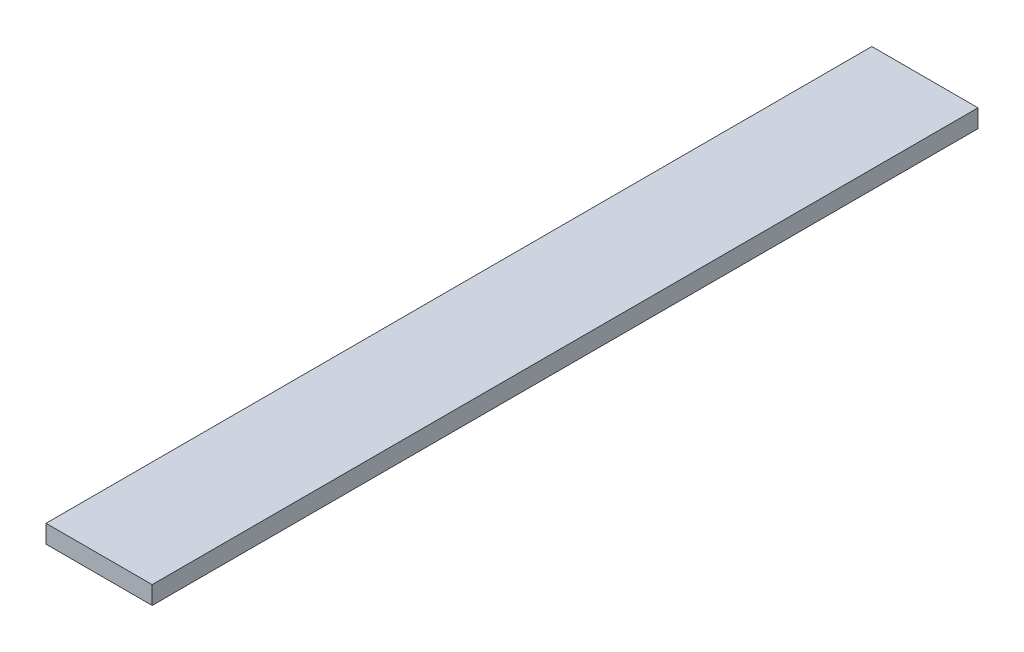
ISO-10303-21;
HEADER;
FILE_DESCRIPTION(('STEP AP214'),'2;1');
FILE_NAME('part.step','',(''),(''),'','','');
FILE_SCHEMA(('AUTOMOTIVE_DESIGN { 1 0 10303 214 1 1 1 1 }'));
ENDSEC;
DATA;
#1=APPLICATION_CONTEXT('core data for automotive mechanical design processes');
#2=APPLICATION_PROTOCOL_DEFINITION('international standard','automotive_design',2000,#1);
#3=PRODUCT_CONTEXT('',#1,'mechanical');
#4=PRODUCT('Part','Part','',(#3));
#5=PRODUCT_RELATED_PRODUCT_CATEGORY('part','',(#4));
#6=PRODUCT_DEFINITION_FORMATION('','',#4);
#7=PRODUCT_DEFINITION_CONTEXT('part definition',#1,'design');
#8=PRODUCT_DEFINITION('design','',#6,#7);
#9=PRODUCT_DEFINITION_SHAPE('','',#8);
#10=(LENGTH_UNIT() NAMED_UNIT(*) SI_UNIT(.MILLI.,.METRE.));
#11=(NAMED_UNIT(*) PLANE_ANGLE_UNIT() SI_UNIT($,.RADIAN.));
#12=(NAMED_UNIT(*) SI_UNIT($,.STERADIAN.) SOLID_ANGLE_UNIT());
#13=UNCERTAINTY_MEASURE_WITH_UNIT(LENGTH_MEASURE(1.E-05),#10,'distance_accuracy_value','');
#14=(GEOMETRIC_REPRESENTATION_CONTEXT(3) GLOBAL_UNCERTAINTY_ASSIGNED_CONTEXT((#13)) GLOBAL_UNIT_ASSIGNED_CONTEXT((#10,
#11,#12)) REPRESENTATION_CONTEXT('',''));
#15=CARTESIAN_POINT('',(0.,0.,0.));
#16=DIRECTION('',(0.,0.,1.));
#17=DIRECTION('',(1.,0.,0.));
#18=AXIS2_PLACEMENT_3D('',#15,#16,#17);
#19=CARTESIAN_POINT('',(0.,0.,-1050.));
#20=DIRECTION('',(-1.,0.,0.));
#21=DIRECTION('',(0.,0.,1.));
#22=AXIS2_PLACEMENT_3D('',#19,#20,#21);
#23=PLANE('',#22);
#24=DIRECTION('',(0.,-1.,0.));
#25=VECTOR('',#24,1.);
#26=CARTESIAN_POINT('',(0.,0.,0.));
#27=LINE('',#26,#25);
#28=CARTESIAN_POINT('',(0.,23.,0.));
#29=VERTEX_POINT('',#28);
#30=CARTESIAN_POINT('',(0.,0.,0.));
#31=VERTEX_POINT('',#30);
#32=EDGE_CURVE('E101',#29,#31,#27,.T.);
#33=ORIENTED_EDGE('',*,*,#32,.F.);
#34=DIRECTION('',(0.,0.,1.));
#35=VECTOR('',#34,1.);
#36=CARTESIAN_POINT('',(0.,23.,-1050.));
#37=LINE('',#36,#35);
#38=CARTESIAN_POINT('',(0.,23.,-1050.));
#39=VERTEX_POINT('',#38);
#40=EDGE_CURVE('E11',#39,#29,#37,.T.);
#41=ORIENTED_EDGE('',*,*,#40,.F.);
#42=DIRECTION('',(0.,-1.,0.));
#43=VECTOR('',#42,1.);
#44=CARTESIAN_POINT('',(0.,0.,-1050.));
#45=LINE('',#44,#43);
#46=CARTESIAN_POINT('',(0.,0.,-1050.));
#47=VERTEX_POINT('',#46);
#48=EDGE_CURVE('E95',#39,#47,#45,.T.);
#49=ORIENTED_EDGE('',*,*,#48,.T.);
#50=DIRECTION('',(0.,0.,1.));
#51=VECTOR('',#50,1.);
#52=CARTESIAN_POINT('',(0.,0.,-1050.));
#53=LINE('',#52,#51);
#54=EDGE_CURVE('E40',#47,#31,#53,.T.);
#55=ORIENTED_EDGE('',*,*,#54,.T.);
#56=EDGE_LOOP('',(#33,#41,#49,#55));
#57=FACE_BOUND('',#56,.T.);
#58=ADVANCED_FACE('F37',(#57),#23,.T.);
#59=CARTESIAN_POINT('',(0.,23.,-1050.));
#60=DIRECTION('',(0.,1.,0.));
#61=DIRECTION('',(0.,0.,1.));
#62=AXIS2_PLACEMENT_3D('',#59,#60,#61);
#63=PLANE('',#62);
#64=DIRECTION('',(-1.,0.,0.));
#65=VECTOR('',#64,1.);
#66=CARTESIAN_POINT('',(0.,23.,0.));
#67=LINE('',#66,#65);
#68=CARTESIAN_POINT('',(135.,23.,0.));
#69=VERTEX_POINT('',#68);
#70=EDGE_CURVE('E97',#69,#29,#67,.T.);
#71=ORIENTED_EDGE('',*,*,#70,.F.);
#72=DIRECTION('',(0.,0.,1.));
#73=VECTOR('',#72,1.);
#74=CARTESIAN_POINT('',(135.,23.,-1050.));
#75=LINE('',#74,#73);
#76=CARTESIAN_POINT('',(135.,23.,-1050.));
#77=VERTEX_POINT('',#76);
#78=EDGE_CURVE('E46',#77,#69,#75,.T.);
#79=ORIENTED_EDGE('',*,*,#78,.F.);
#80=DIRECTION('',(-1.,0.,0.));
#81=VECTOR('',#80,1.);
#82=CARTESIAN_POINT('',(0.,23.,-1050.));
#83=LINE('',#82,#81);
#84=EDGE_CURVE('E92',#77,#39,#83,.T.);
#85=ORIENTED_EDGE('',*,*,#84,.T.);
#86=ORIENTED_EDGE('',*,*,#40,.T.);
#87=EDGE_LOOP('',(#71,#79,#85,#86));
#88=FACE_BOUND('',#87,.T.);
#89=ADVANCED_FACE('F111',(#88),#63,.T.);
#90=CARTESIAN_POINT('',(135.,0.,-1050.));
#91=DIRECTION('',(1.,0.,0.));
#92=DIRECTION('',(0.,0.,-1.));
#93=AXIS2_PLACEMENT_3D('',#90,#91,#92);
#94=PLANE('',#93);
#95=DIRECTION('',(0.,1.,0.));
#96=VECTOR('',#95,1.);
#97=CARTESIAN_POINT('',(135.,0.,0.));
#98=LINE('',#97,#96);
#99=CARTESIAN_POINT('',(135.,0.,0.));
#100=VERTEX_POINT('',#99);
#101=EDGE_CURVE('E87',#100,#69,#98,.T.);
#102=ORIENTED_EDGE('',*,*,#101,.F.);
#103=DIRECTION('',(0.,0.,1.));
#104=VECTOR('',#103,1.);
#105=CARTESIAN_POINT('',(135.,0.,-1050.));
#106=LINE('',#105,#104);
#107=CARTESIAN_POINT('',(135.,0.,-1050.));
#108=VERTEX_POINT('',#107);
#109=EDGE_CURVE('E82',#108,#100,#106,.T.);
#110=ORIENTED_EDGE('',*,*,#109,.F.);
#111=DIRECTION('',(0.,1.,0.));
#112=VECTOR('',#111,1.);
#113=CARTESIAN_POINT('',(135.,0.,-1050.));
#114=LINE('',#113,#112);
#115=EDGE_CURVE('E85',#108,#77,#114,.T.);
#116=ORIENTED_EDGE('',*,*,#115,.T.);
#117=ORIENTED_EDGE('',*,*,#78,.T.);
#118=EDGE_LOOP('',(#102,#110,#116,#117));
#119=FACE_BOUND('',#118,.T.);
#120=ADVANCED_FACE('F84',(#119),#94,.T.);
#121=CARTESIAN_POINT('',(0.,0.,-1050.));
#122=DIRECTION('',(0.,-1.,0.));
#123=DIRECTION('',(0.,0.,-1.));
#124=AXIS2_PLACEMENT_3D('',#121,#122,#123);
#125=PLANE('',#124);
#126=DIRECTION('',(1.,0.,0.));
#127=VECTOR('',#126,1.);
#128=CARTESIAN_POINT('',(0.,0.,0.));
#129=LINE('',#128,#127);
#130=EDGE_CURVE('E104',#31,#100,#129,.T.);
#131=ORIENTED_EDGE('',*,*,#130,.F.);
#132=ORIENTED_EDGE('',*,*,#54,.F.);
#133=DIRECTION('',(1.,0.,0.));
#134=VECTOR('',#133,1.);
#135=CARTESIAN_POINT('',(0.,0.,-1050.));
#136=LINE('',#135,#134);
#137=EDGE_CURVE('E91',#47,#108,#136,.T.);
#138=ORIENTED_EDGE('',*,*,#137,.T.);
#139=ORIENTED_EDGE('',*,*,#109,.T.);
#140=EDGE_LOOP('',(#131,#132,#138,#139));
#141=FACE_BOUND('',#140,.T.);
#142=ADVANCED_FACE('F94',(#141),#125,.T.);
#143=CARTESIAN_POINT('',(0.,0.,-1050.));
#144=DIRECTION('',(0.,0.,-1.));
#145=DIRECTION('',(-1.,0.,0.));
#146=AXIS2_PLACEMENT_3D('',#143,#144,#145);
#147=PLANE('',#146);
#148=ORIENTED_EDGE('',*,*,#48,.F.);
#149=ORIENTED_EDGE('',*,*,#84,.F.);
#150=ORIENTED_EDGE('',*,*,#115,.F.);
#151=ORIENTED_EDGE('',*,*,#137,.F.);
#152=EDGE_LOOP('',(#148,#149,#150,#151));
#153=FACE_BOUND('',#152,.T.);
#154=ADVANCED_FACE('F90',(#153),#147,.T.);
#155=CARTESIAN_POINT('',(0.,0.,0.));
#156=DIRECTION('',(0.,0.,-1.));
#157=DIRECTION('',(-1.,0.,0.));
#158=AXIS2_PLACEMENT_3D('',#155,#156,#157);
#159=PLANE('',#158);
#160=ORIENTED_EDGE('',*,*,#32,.T.);
#161=ORIENTED_EDGE('',*,*,#130,.T.);
#162=ORIENTED_EDGE('',*,*,#101,.T.);
#163=ORIENTED_EDGE('',*,*,#70,.T.);
#164=EDGE_LOOP('',(#160,#161,#162,#163));
#165=FACE_BOUND('',#164,.T.);
#166=ADVANCED_FACE('F110',(#165),#159,.F.);
#167=CLOSED_SHELL('',(#58,#89,#120,#142,#154,#166));
#168=MANIFOLD_SOLID_BREP('B2',#167);
#169=ADVANCED_BREP_SHAPE_REPRESENTATION('',(#18,#168),#14);
#170=SHAPE_DEFINITION_REPRESENTATION(#9,#169);
ENDSEC;
END-ISO-10303-21;
